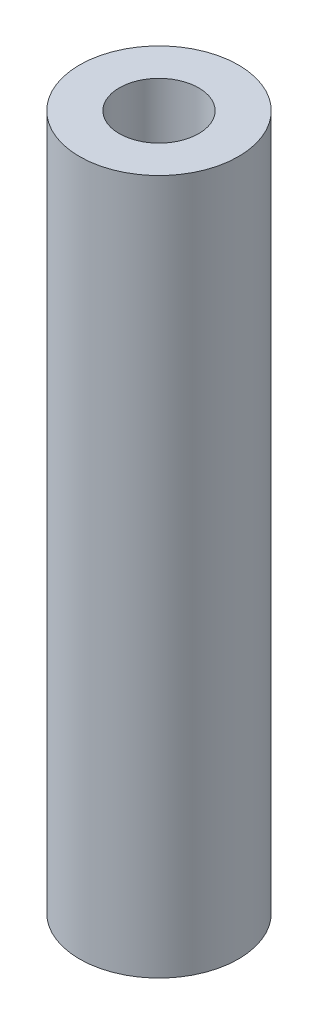
ISO-10303-21;
HEADER;
FILE_DESCRIPTION(('STEP AP214'),'2;1');
FILE_NAME('part.step','',(''),(''),'','','');
FILE_SCHEMA(('AUTOMOTIVE_DESIGN { 1 0 10303 214 1 1 1 1 }'));
ENDSEC;
DATA;
#1=APPLICATION_CONTEXT('core data for automotive mechanical design processes');
#2=APPLICATION_PROTOCOL_DEFINITION('international standard','automotive_design',2000,#1);
#3=PRODUCT_CONTEXT('',#1,'mechanical');
#4=PRODUCT('Part','Part','',(#3));
#5=PRODUCT_RELATED_PRODUCT_CATEGORY('part','',(#4));
#6=PRODUCT_DEFINITION_FORMATION('','',#4);
#7=PRODUCT_DEFINITION_CONTEXT('part definition',#1,'design');
#8=PRODUCT_DEFINITION('design','',#6,#7);
#9=PRODUCT_DEFINITION_SHAPE('','',#8);
#10=(LENGTH_UNIT() NAMED_UNIT(*) SI_UNIT(.MILLI.,.METRE.));
#11=(NAMED_UNIT(*) PLANE_ANGLE_UNIT() SI_UNIT($,.RADIAN.));
#12=(NAMED_UNIT(*) SI_UNIT($,.STERADIAN.) SOLID_ANGLE_UNIT());
#13=UNCERTAINTY_MEASURE_WITH_UNIT(LENGTH_MEASURE(1.E-05),#10,'distance_accuracy_value','');
#14=(GEOMETRIC_REPRESENTATION_CONTEXT(3) GLOBAL_UNCERTAINTY_ASSIGNED_CONTEXT((#13)) GLOBAL_UNIT_ASSIGNED_CONTEXT((#10,
#11,#12)) REPRESENTATION_CONTEXT('',''));
#15=CARTESIAN_POINT('',(0.,0.,0.));
#16=DIRECTION('',(0.,0.,1.));
#17=DIRECTION('',(1.,0.,0.));
#18=AXIS2_PLACEMENT_3D('',#15,#16,#17);
#19=CARTESIAN_POINT('',(0.,35.,0.));
#20=DIRECTION('',(0.,-1.,0.));
#21=DIRECTION('',(0.,0.,-1.));
#22=AXIS2_PLACEMENT_3D('',#19,#20,#21);
#23=CYLINDRICAL_SURFACE('',#22,4.);
#24=CARTESIAN_POINT('',(0.,35.,0.));
#25=DIRECTION('',(0.,1.,0.));
#26=DIRECTION('',(0.,0.,1.));
#27=AXIS2_PLACEMENT_3D('',#24,#25,#26);
#28=CIRCLE('',#27,4.);
#29=CARTESIAN_POINT('',(0.,35.,4.));
#30=VERTEX_POINT('',#29);
#31=EDGE_CURVE('E10',#30,#30,#28,.T.);
#32=ORIENTED_EDGE('',*,*,#31,.F.);
#33=EDGE_LOOP('',(#32));
#34=FACE_BOUND('',#33,.T.);
#35=CARTESIAN_POINT('',(0.,0.,0.));
#36=DIRECTION('',(0.,1.,0.));
#37=DIRECTION('',(0.,0.,1.));
#38=AXIS2_PLACEMENT_3D('',#35,#36,#37);
#39=CIRCLE('',#38,4.);
#40=CARTESIAN_POINT('',(0.,0.,4.));
#41=VERTEX_POINT('',#40);
#42=EDGE_CURVE('E34',#41,#41,#39,.T.);
#43=ORIENTED_EDGE('',*,*,#42,.T.);
#44=EDGE_LOOP('',(#43));
#45=FACE_BOUND('',#44,.T.);
#46=ADVANCED_FACE('F31',(#34,#45),#23,.T.);
#47=CARTESIAN_POINT('',(0.,35.,0.));
#48=DIRECTION('',(0.,1.,0.));
#49=DIRECTION('',(0.,0.,1.));
#50=AXIS2_PLACEMENT_3D('',#47,#48,#49);
#51=PLANE('',#50);
#52=CARTESIAN_POINT('',(0.,35.,0.));
#53=DIRECTION('',(0.,1.,0.));
#54=DIRECTION('',(0.,0.,1.));
#55=AXIS2_PLACEMENT_3D('',#52,#53,#54);
#56=CIRCLE('',#55,2.);
#57=CARTESIAN_POINT('',(0.,35.,2.));
#58=VERTEX_POINT('',#57);
#59=EDGE_CURVE('E43',#58,#58,#56,.T.);
#60=ORIENTED_EDGE('',*,*,#59,.F.);
#61=EDGE_LOOP('',(#60));
#62=FACE_BOUND('',#61,.T.);
#63=ORIENTED_EDGE('',*,*,#31,.T.);
#64=EDGE_LOOP('',(#63));
#65=FACE_BOUND('',#64,.T.);
#66=ADVANCED_FACE('F58',(#62,#65),#51,.T.);
#67=CARTESIAN_POINT('',(0.,0.,0.));
#68=DIRECTION('',(0.,1.,0.));
#69=DIRECTION('',(0.,0.,1.));
#70=AXIS2_PLACEMENT_3D('',#67,#68,#69);
#71=PLANE('',#70);
#72=ORIENTED_EDGE('',*,*,#42,.F.);
#73=EDGE_LOOP('',(#72));
#74=FACE_BOUND('',#73,.T.);
#75=ADVANCED_FACE('F54',(#74),#71,.F.);
#76=CARTESIAN_POINT('',(0.,30.,0.));
#77=DIRECTION('',(0.,1.,0.));
#78=DIRECTION('',(0.,0.,1.));
#79=AXIS2_PLACEMENT_3D('',#76,#77,#78);
#80=CYLINDRICAL_SURFACE('',#79,2.);
#81=CARTESIAN_POINT('',(0.,30.,0.));
#82=DIRECTION('',(0.,1.,0.));
#83=DIRECTION('',(0.,0.,1.));
#84=AXIS2_PLACEMENT_3D('',#81,#82,#83);
#85=CIRCLE('',#84,2.);
#86=CARTESIAN_POINT('',(0.,30.,2.));
#87=VERTEX_POINT('',#86);
#88=EDGE_CURVE('E41',#87,#87,#85,.T.);
#89=ORIENTED_EDGE('',*,*,#88,.F.);
#90=EDGE_LOOP('',(#89));
#91=FACE_BOUND('',#90,.T.);
#92=ORIENTED_EDGE('',*,*,#59,.T.);
#93=EDGE_LOOP('',(#92));
#94=FACE_BOUND('',#93,.T.);
#95=ADVANCED_FACE('F51',(#91,#94),#80,.F.);
#96=CARTESIAN_POINT('',(0.,30.,0.));
#97=DIRECTION('',(0.,1.,0.));
#98=DIRECTION('',(0.,0.,1.));
#99=AXIS2_PLACEMENT_3D('',#96,#97,#98);
#100=PLANE('',#99);
#101=ORIENTED_EDGE('',*,*,#88,.T.);
#102=EDGE_LOOP('',(#101));
#103=FACE_BOUND('',#102,.T.);
#104=ADVANCED_FACE('F49',(#103),#100,.T.);
#105=CLOSED_SHELL('',(#46,#66,#75,#95,#104));
#106=MANIFOLD_SOLID_BREP('B2',#105);
#107=ADVANCED_BREP_SHAPE_REPRESENTATION('',(#18,#106),#14);
#108=SHAPE_DEFINITION_REPRESENTATION(#9,#107);
ENDSEC;
END-ISO-10303-21;
